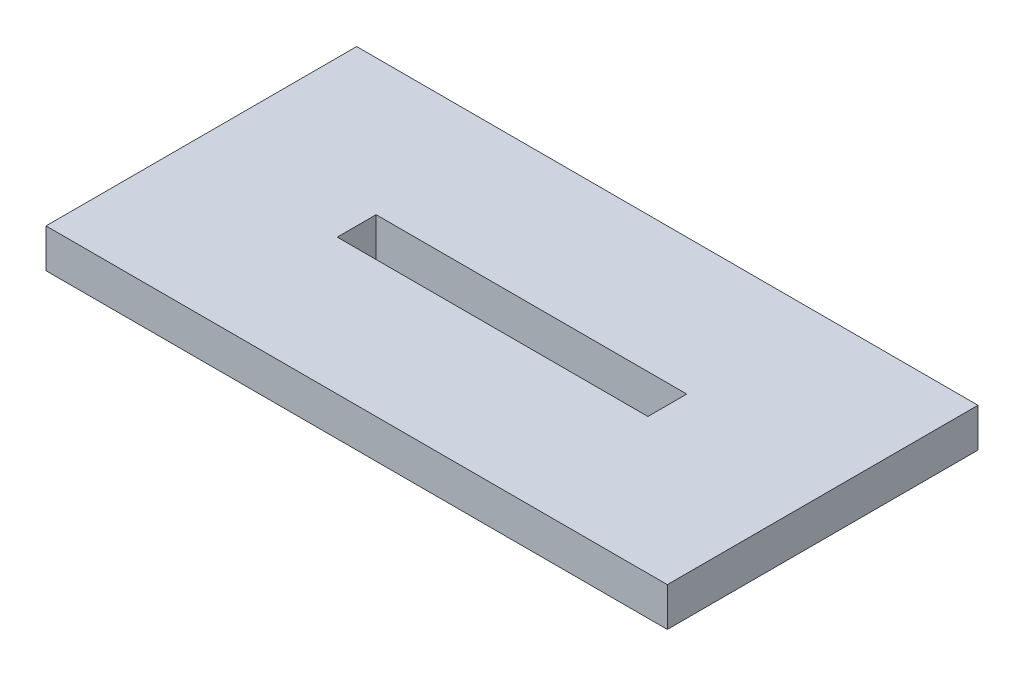
ISO-10303-21;
HEADER;
FILE_DESCRIPTION(('STEP AP214'),'2;1');
FILE_NAME('part.step','',(''),(''),'','','');
FILE_SCHEMA(('AUTOMOTIVE_DESIGN { 1 0 10303 214 1 1 1 1 }'));
ENDSEC;
DATA;
#1=APPLICATION_CONTEXT('core data for automotive mechanical design processes');
#2=APPLICATION_PROTOCOL_DEFINITION('international standard','automotive_design',2000,#1);
#3=PRODUCT_CONTEXT('',#1,'mechanical');
#4=PRODUCT('Part','Part','',(#3));
#5=PRODUCT_RELATED_PRODUCT_CATEGORY('part','',(#4));
#6=PRODUCT_DEFINITION_FORMATION('','',#4);
#7=PRODUCT_DEFINITION_CONTEXT('part definition',#1,'design');
#8=PRODUCT_DEFINITION('design','',#6,#7);
#9=PRODUCT_DEFINITION_SHAPE('','',#8);
#10=(LENGTH_UNIT() NAMED_UNIT(*) SI_UNIT(.MILLI.,.METRE.));
#11=(NAMED_UNIT(*) PLANE_ANGLE_UNIT() SI_UNIT($,.RADIAN.));
#12=(NAMED_UNIT(*) SI_UNIT($,.STERADIAN.) SOLID_ANGLE_UNIT());
#13=UNCERTAINTY_MEASURE_WITH_UNIT(LENGTH_MEASURE(1.E-05),#10,'distance_accuracy_value','');
#14=(GEOMETRIC_REPRESENTATION_CONTEXT(3) GLOBAL_UNCERTAINTY_ASSIGNED_CONTEXT((#13)) GLOBAL_UNIT_ASSIGNED_CONTEXT((#10,
#11,#12)) REPRESENTATION_CONTEXT('',''));
#15=CARTESIAN_POINT('',(0.,0.,0.));
#16=DIRECTION('',(0.,0.,1.));
#17=DIRECTION('',(1.,0.,0.));
#18=AXIS2_PLACEMENT_3D('',#15,#16,#17);
#19=CARTESIAN_POINT('',(0.,3.175,0.));
#20=DIRECTION('',(0.,-1.,0.));
#21=DIRECTION('',(0.,0.,-1.));
#22=AXIS2_PLACEMENT_3D('',#19,#20,#21);
#23=PLANE('',#22);
#24=DIRECTION('',(0.,0.,-1.));
#25=VECTOR('',#24,1.);
#26=CARTESIAN_POINT('',(25.4,3.175,12.7));
#27=LINE('',#26,#25);
#28=CARTESIAN_POINT('',(25.4,3.175,12.7));
#29=VERTEX_POINT('',#28);
#30=CARTESIAN_POINT('',(25.4,3.175,-12.7));
#31=VERTEX_POINT('',#30);
#32=EDGE_CURVE('E134',#29,#31,#27,.T.);
#33=ORIENTED_EDGE('',*,*,#32,.T.);
#34=DIRECTION('',(-1.,0.,0.));
#35=VECTOR('',#34,1.);
#36=CARTESIAN_POINT('',(-25.4,3.175,-12.7));
#37=LINE('',#36,#35);
#38=CARTESIAN_POINT('',(-25.4,3.175,-12.7));
#39=VERTEX_POINT('',#38);
#40=EDGE_CURVE('E137',#31,#39,#37,.T.);
#41=ORIENTED_EDGE('',*,*,#40,.T.);
#42=DIRECTION('',(0.,0.,1.));
#43=VECTOR('',#42,1.);
#44=CARTESIAN_POINT('',(-25.4,3.175,12.7));
#45=LINE('',#44,#43);
#46=CARTESIAN_POINT('',(-25.4,3.175,12.7));
#47=VERTEX_POINT('',#46);
#48=EDGE_CURVE('E140',#39,#47,#45,.T.);
#49=ORIENTED_EDGE('',*,*,#48,.T.);
#50=DIRECTION('',(1.,0.,0.));
#51=VECTOR('',#50,1.);
#52=CARTESIAN_POINT('',(-25.4,3.175,12.7));
#53=LINE('',#52,#51);
#54=EDGE_CURVE('E142',#47,#29,#53,.T.);
#55=ORIENTED_EDGE('',*,*,#54,.T.);
#56=EDGE_LOOP('',(#33,#41,#49,#55));
#57=FACE_BOUND('',#56,.T.);
#58=DIRECTION('',(0.,0.,-1.));
#59=VECTOR('',#58,1.);
#60=CARTESIAN_POINT('',(12.7,3.175,-1.5875));
#61=LINE('',#60,#59);
#62=CARTESIAN_POINT('',(12.7,3.175,1.5875));
#63=VERTEX_POINT('',#62);
#64=CARTESIAN_POINT('',(12.7,3.175,-1.5875));
#65=VERTEX_POINT('',#64);
#66=EDGE_CURVE('E98',#63,#65,#61,.T.);
#67=ORIENTED_EDGE('',*,*,#66,.F.);
#68=DIRECTION('',(1.,0.,0.));
#69=VECTOR('',#68,1.);
#70=CARTESIAN_POINT('',(-12.7,3.175,1.5875));
#71=LINE('',#70,#69);
#72=CARTESIAN_POINT('',(-12.7,3.175,1.5875));
#73=VERTEX_POINT('',#72);
#74=EDGE_CURVE('E120',#73,#63,#71,.T.);
#75=ORIENTED_EDGE('',*,*,#74,.F.);
#76=DIRECTION('',(0.,0.,1.));
#77=VECTOR('',#76,1.);
#78=CARTESIAN_POINT('',(-12.7,3.175,-1.5875));
#79=LINE('',#78,#77);
#80=CARTESIAN_POINT('',(-12.7,3.175,-1.5875));
#81=VERTEX_POINT('',#80);
#82=EDGE_CURVE('E118',#81,#73,#79,.T.);
#83=ORIENTED_EDGE('',*,*,#82,.F.);
#84=DIRECTION('',(-1.,0.,0.));
#85=VECTOR('',#84,1.);
#86=CARTESIAN_POINT('',(-12.7,3.175,-1.5875));
#87=LINE('',#86,#85);
#88=EDGE_CURVE('E106',#65,#81,#87,.T.);
#89=ORIENTED_EDGE('',*,*,#88,.F.);
#90=EDGE_LOOP('',(#67,#75,#83,#89));
#91=FACE_BOUND('',#90,.T.);
#92=ADVANCED_FACE('F33',(#57,#91),#23,.F.);
#93=CARTESIAN_POINT('',(0.,0.,0.));
#94=DIRECTION('',(0.,-1.,0.));
#95=DIRECTION('',(0.,0.,-1.));
#96=AXIS2_PLACEMENT_3D('',#93,#94,#95);
#97=PLANE('',#96);
#98=DIRECTION('',(0.,0.,-1.));
#99=VECTOR('',#98,1.);
#100=CARTESIAN_POINT('',(25.4,0.,12.7));
#101=LINE('',#100,#99);
#102=CARTESIAN_POINT('',(25.4,0.,12.7));
#103=VERTEX_POINT('',#102);
#104=CARTESIAN_POINT('',(25.4,0.,-12.7));
#105=VERTEX_POINT('',#104);
#106=EDGE_CURVE('E114',#103,#105,#101,.T.);
#107=ORIENTED_EDGE('',*,*,#106,.F.);
#108=DIRECTION('',(1.,0.,0.));
#109=VECTOR('',#108,1.);
#110=CARTESIAN_POINT('',(-25.4,0.,12.7));
#111=LINE('',#110,#109);
#112=CARTESIAN_POINT('',(-25.4,0.,12.7));
#113=VERTEX_POINT('',#112);
#114=EDGE_CURVE('E138',#113,#103,#111,.T.);
#115=ORIENTED_EDGE('',*,*,#114,.F.);
#116=DIRECTION('',(0.,0.,1.));
#117=VECTOR('',#116,1.);
#118=CARTESIAN_POINT('',(-25.4,0.,12.7));
#119=LINE('',#118,#117);
#120=CARTESIAN_POINT('',(-25.4,0.,-12.7));
#121=VERTEX_POINT('',#120);
#122=EDGE_CURVE('E149',#121,#113,#119,.T.);
#123=ORIENTED_EDGE('',*,*,#122,.F.);
#124=DIRECTION('',(-1.,0.,0.));
#125=VECTOR('',#124,1.);
#126=CARTESIAN_POINT('',(-25.4,0.,-12.7));
#127=LINE('',#126,#125);
#128=EDGE_CURVE('E147',#105,#121,#127,.T.);
#129=ORIENTED_EDGE('',*,*,#128,.F.);
#130=EDGE_LOOP('',(#107,#115,#123,#129));
#131=FACE_BOUND('',#130,.T.);
#132=DIRECTION('',(1.,0.,0.));
#133=VECTOR('',#132,1.);
#134=CARTESIAN_POINT('',(-12.7,0.,1.5875));
#135=LINE('',#134,#133);
#136=CARTESIAN_POINT('',(-12.7,0.,1.5875));
#137=VERTEX_POINT('',#136);
#138=CARTESIAN_POINT('',(12.7,0.,1.5875));
#139=VERTEX_POINT('',#138);
#140=EDGE_CURVE('E107',#137,#139,#135,.T.);
#141=ORIENTED_EDGE('',*,*,#140,.T.);
#142=DIRECTION('',(0.,0.,-1.));
#143=VECTOR('',#142,1.);
#144=CARTESIAN_POINT('',(12.7,0.,-1.5875));
#145=LINE('',#144,#143);
#146=CARTESIAN_POINT('',(12.7,0.,-1.5875));
#147=VERTEX_POINT('',#146);
#148=EDGE_CURVE('E56',#139,#147,#145,.T.);
#149=ORIENTED_EDGE('',*,*,#148,.T.);
#150=DIRECTION('',(-1.,0.,0.));
#151=VECTOR('',#150,1.);
#152=CARTESIAN_POINT('',(-12.7,0.,-1.5875));
#153=LINE('',#152,#151);
#154=CARTESIAN_POINT('',(-12.7,0.,-1.5875));
#155=VERTEX_POINT('',#154);
#156=EDGE_CURVE('E113',#147,#155,#153,.T.);
#157=ORIENTED_EDGE('',*,*,#156,.T.);
#158=DIRECTION('',(0.,0.,1.));
#159=VECTOR('',#158,1.);
#160=CARTESIAN_POINT('',(-12.7,0.,-1.5875));
#161=LINE('',#160,#159);
#162=EDGE_CURVE('E126',#155,#137,#161,.T.);
#163=ORIENTED_EDGE('',*,*,#162,.T.);
#164=EDGE_LOOP('',(#141,#149,#157,#163));
#165=FACE_BOUND('',#164,.T.);
#166=ADVANCED_FACE('F167',(#131,#165),#97,.T.);
#167=CARTESIAN_POINT('',(25.4,3.175,12.7));
#168=DIRECTION('',(-1.,0.,0.));
#169=DIRECTION('',(0.,0.,1.));
#170=AXIS2_PLACEMENT_3D('',#167,#168,#169);
#171=PLANE('',#170);
#172=ORIENTED_EDGE('',*,*,#106,.T.);
#173=DIRECTION('',(0.,-1.,0.));
#174=VECTOR('',#173,1.);
#175=CARTESIAN_POINT('',(25.4,3.175,-12.7));
#176=LINE('',#175,#174);
#177=EDGE_CURVE('E11',#31,#105,#176,.T.);
#178=ORIENTED_EDGE('',*,*,#177,.F.);
#179=ORIENTED_EDGE('',*,*,#32,.F.);
#180=DIRECTION('',(0.,-1.,0.));
#181=VECTOR('',#180,1.);
#182=CARTESIAN_POINT('',(25.4,3.175,12.7));
#183=LINE('',#182,#181);
#184=EDGE_CURVE('E144',#29,#103,#183,.T.);
#185=ORIENTED_EDGE('',*,*,#184,.T.);
#186=EDGE_LOOP('',(#172,#178,#179,#185));
#187=FACE_BOUND('',#186,.T.);
#188=ADVANCED_FACE('F35',(#187),#171,.F.);
#189=CARTESIAN_POINT('',(-25.4,3.175,-12.7));
#190=DIRECTION('',(0.,0.,1.));
#191=DIRECTION('',(1.,0.,0.));
#192=AXIS2_PLACEMENT_3D('',#189,#190,#191);
#193=PLANE('',#192);
#194=ORIENTED_EDGE('',*,*,#128,.T.);
#195=DIRECTION('',(0.,-1.,0.));
#196=VECTOR('',#195,1.);
#197=CARTESIAN_POINT('',(-25.4,3.175,-12.7));
#198=LINE('',#197,#196);
#199=EDGE_CURVE('E41',#39,#121,#198,.T.);
#200=ORIENTED_EDGE('',*,*,#199,.F.);
#201=ORIENTED_EDGE('',*,*,#40,.F.);
#202=ORIENTED_EDGE('',*,*,#177,.T.);
#203=EDGE_LOOP('',(#194,#200,#201,#202));
#204=FACE_BOUND('',#203,.T.);
#205=ADVANCED_FACE('F177',(#204),#193,.F.);
#206=CARTESIAN_POINT('',(-25.4,3.175,12.7));
#207=DIRECTION('',(1.,0.,0.));
#208=DIRECTION('',(0.,0.,-1.));
#209=AXIS2_PLACEMENT_3D('',#206,#207,#208);
#210=PLANE('',#209);
#211=ORIENTED_EDGE('',*,*,#122,.T.);
#212=DIRECTION('',(0.,-1.,0.));
#213=VECTOR('',#212,1.);
#214=CARTESIAN_POINT('',(-25.4,3.175,12.7));
#215=LINE('',#214,#213);
#216=EDGE_CURVE('E154',#47,#113,#215,.T.);
#217=ORIENTED_EDGE('',*,*,#216,.F.);
#218=ORIENTED_EDGE('',*,*,#48,.F.);
#219=ORIENTED_EDGE('',*,*,#199,.T.);
#220=EDGE_LOOP('',(#211,#217,#218,#219));
#221=FACE_BOUND('',#220,.T.);
#222=ADVANCED_FACE('F161',(#221),#210,.F.);
#223=CARTESIAN_POINT('',(-25.4,3.175,12.7));
#224=DIRECTION('',(0.,0.,-1.));
#225=DIRECTION('',(-1.,0.,0.));
#226=AXIS2_PLACEMENT_3D('',#223,#224,#225);
#227=PLANE('',#226);
#228=ORIENTED_EDGE('',*,*,#114,.T.);
#229=ORIENTED_EDGE('',*,*,#184,.F.);
#230=ORIENTED_EDGE('',*,*,#54,.F.);
#231=ORIENTED_EDGE('',*,*,#216,.T.);
#232=EDGE_LOOP('',(#228,#229,#230,#231));
#233=FACE_BOUND('',#232,.T.);
#234=ADVANCED_FACE('F171',(#233),#227,.F.);
#235=CARTESIAN_POINT('',(12.7,3.175,-1.5875));
#236=DIRECTION('',(-1.,0.,0.));
#237=DIRECTION('',(0.,0.,1.));
#238=AXIS2_PLACEMENT_3D('',#235,#236,#237);
#239=PLANE('',#238);
#240=ORIENTED_EDGE('',*,*,#148,.F.);
#241=DIRECTION('',(0.,-1.,0.));
#242=VECTOR('',#241,1.);
#243=CARTESIAN_POINT('',(12.7,3.175,1.5875));
#244=LINE('',#243,#242);
#245=EDGE_CURVE('E102',#63,#139,#244,.T.);
#246=ORIENTED_EDGE('',*,*,#245,.F.);
#247=ORIENTED_EDGE('',*,*,#66,.T.);
#248=DIRECTION('',(0.,-1.,0.));
#249=VECTOR('',#248,1.);
#250=CARTESIAN_POINT('',(12.7,3.175,-1.5875));
#251=LINE('',#250,#249);
#252=EDGE_CURVE('E101',#65,#147,#251,.T.);
#253=ORIENTED_EDGE('',*,*,#252,.T.);
#254=EDGE_LOOP('',(#240,#246,#247,#253));
#255=FACE_BOUND('',#254,.T.);
#256=ADVANCED_FACE('F100',(#255),#239,.T.);
#257=CARTESIAN_POINT('',(-12.7,3.175,-1.5875));
#258=DIRECTION('',(0.,0.,1.));
#259=DIRECTION('',(1.,0.,0.));
#260=AXIS2_PLACEMENT_3D('',#257,#258,#259);
#261=PLANE('',#260);
#262=ORIENTED_EDGE('',*,*,#156,.F.);
#263=ORIENTED_EDGE('',*,*,#252,.F.);
#264=ORIENTED_EDGE('',*,*,#88,.T.);
#265=DIRECTION('',(0.,-1.,0.));
#266=VECTOR('',#265,1.);
#267=CARTESIAN_POINT('',(-12.7,3.175,-1.5875));
#268=LINE('',#267,#266);
#269=EDGE_CURVE('E115',#81,#155,#268,.T.);
#270=ORIENTED_EDGE('',*,*,#269,.T.);
#271=EDGE_LOOP('',(#262,#263,#264,#270));
#272=FACE_BOUND('',#271,.T.);
#273=ADVANCED_FACE('F110',(#272),#261,.T.);
#274=CARTESIAN_POINT('',(-12.7,3.175,-1.5875));
#275=DIRECTION('',(1.,0.,0.));
#276=DIRECTION('',(0.,0.,-1.));
#277=AXIS2_PLACEMENT_3D('',#274,#275,#276);
#278=PLANE('',#277);
#279=ORIENTED_EDGE('',*,*,#162,.F.);
#280=ORIENTED_EDGE('',*,*,#269,.F.);
#281=ORIENTED_EDGE('',*,*,#82,.T.);
#282=DIRECTION('',(0.,-1.,0.));
#283=VECTOR('',#282,1.);
#284=CARTESIAN_POINT('',(-12.7,3.175,1.5875));
#285=LINE('',#284,#283);
#286=EDGE_CURVE('E48',#73,#137,#285,.T.);
#287=ORIENTED_EDGE('',*,*,#286,.T.);
#288=EDGE_LOOP('',(#279,#280,#281,#287));
#289=FACE_BOUND('',#288,.T.);
#290=ADVANCED_FACE('F200',(#289),#278,.T.);
#291=CARTESIAN_POINT('',(-12.7,3.175,1.5875));
#292=DIRECTION('',(0.,0.,-1.));
#293=DIRECTION('',(-1.,0.,0.));
#294=AXIS2_PLACEMENT_3D('',#291,#292,#293);
#295=PLANE('',#294);
#296=ORIENTED_EDGE('',*,*,#140,.F.);
#297=ORIENTED_EDGE('',*,*,#286,.F.);
#298=ORIENTED_EDGE('',*,*,#74,.T.);
#299=ORIENTED_EDGE('',*,*,#245,.T.);
#300=EDGE_LOOP('',(#296,#297,#298,#299));
#301=FACE_BOUND('',#300,.T.);
#302=ADVANCED_FACE('F204',(#301),#295,.T.);
#303=CLOSED_SHELL('',(#92,#166,#188,#205,#222,#234,#256,#273,#290,#302));
#304=MANIFOLD_SOLID_BREP('B2',#303);
#305=ADVANCED_BREP_SHAPE_REPRESENTATION('',(#18,#304),#14);
#306=SHAPE_DEFINITION_REPRESENTATION(#9,#305);
ENDSEC;
END-ISO-10303-21;
